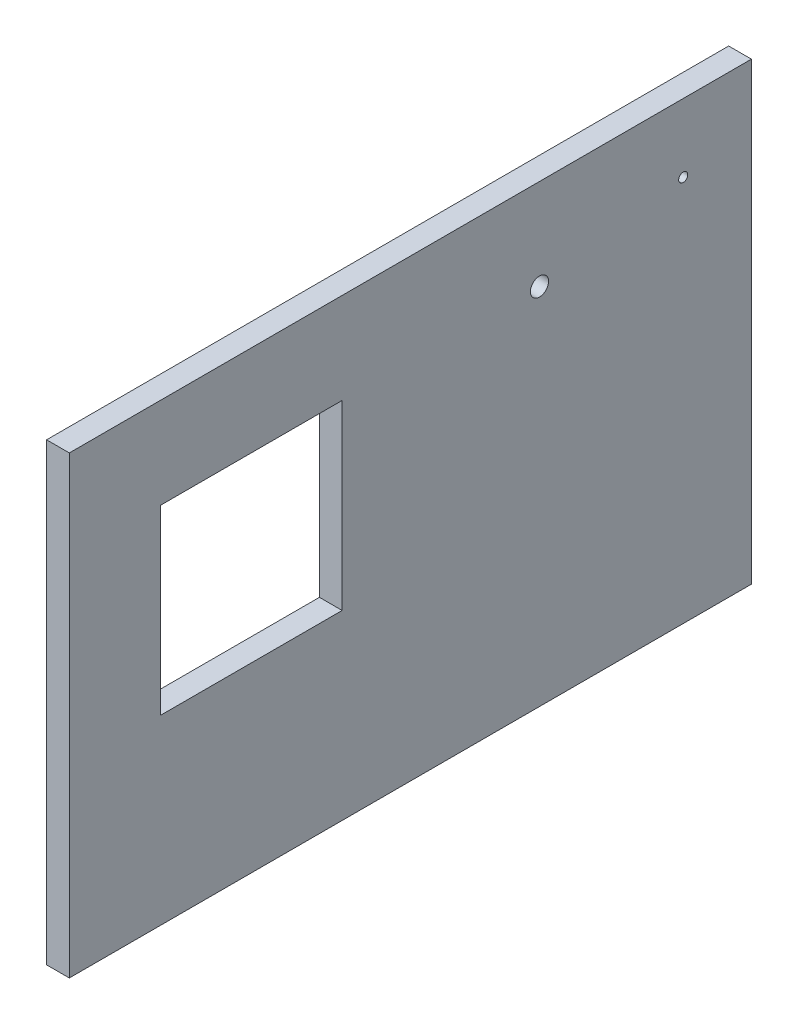
ISO-10303-21;
HEADER;
FILE_DESCRIPTION(('STEP AP214'),'2;1');
FILE_NAME('part.step','',(''),(''),'','','');
FILE_SCHEMA(('AUTOMOTIVE_DESIGN { 1 0 10303 214 1 1 1 1 }'));
ENDSEC;
DATA;
#1=APPLICATION_CONTEXT('core data for automotive mechanical design processes');
#2=APPLICATION_PROTOCOL_DEFINITION('international standard','automotive_design',2000,#1);
#3=PRODUCT_CONTEXT('',#1,'mechanical');
#4=PRODUCT('Part','Part','',(#3));
#5=PRODUCT_RELATED_PRODUCT_CATEGORY('part','',(#4));
#6=PRODUCT_DEFINITION_FORMATION('','',#4);
#7=PRODUCT_DEFINITION_CONTEXT('part definition',#1,'design');
#8=PRODUCT_DEFINITION('design','',#6,#7);
#9=PRODUCT_DEFINITION_SHAPE('','',#8);
#10=(LENGTH_UNIT() NAMED_UNIT(*) SI_UNIT(.MILLI.,.METRE.));
#11=(NAMED_UNIT(*) PLANE_ANGLE_UNIT() SI_UNIT($,.RADIAN.));
#12=(NAMED_UNIT(*) SI_UNIT($,.STERADIAN.) SOLID_ANGLE_UNIT());
#13=UNCERTAINTY_MEASURE_WITH_UNIT(LENGTH_MEASURE(1.E-05),#10,'distance_accuracy_value','');
#14=(GEOMETRIC_REPRESENTATION_CONTEXT(3) GLOBAL_UNCERTAINTY_ASSIGNED_CONTEXT((#13)) GLOBAL_UNIT_ASSIGNED_CONTEXT((#10,
#11,#12)) REPRESENTATION_CONTEXT('',''));
#15=CARTESIAN_POINT('',(0.,0.,0.));
#16=DIRECTION('',(0.,0.,1.));
#17=DIRECTION('',(1.,0.,0.));
#18=AXIS2_PLACEMENT_3D('',#15,#16,#17);
#19=CARTESIAN_POINT('',(10.,100.,-150.));
#20=DIRECTION('',(0.,0.,1.));
#21=DIRECTION('',(1.,0.,0.));
#22=AXIS2_PLACEMENT_3D('',#19,#20,#21);
#23=PLANE('',#22);
#24=DIRECTION('',(0.,1.,0.));
#25=VECTOR('',#24,1.);
#26=CARTESIAN_POINT('',(0.,100.,-150.));
#27=LINE('',#26,#25);
#28=CARTESIAN_POINT('',(0.,-100.,-150.));
#29=VERTEX_POINT('',#28);
#30=CARTESIAN_POINT('',(0.,100.,-150.));
#31=VERTEX_POINT('',#30);
#32=EDGE_CURVE('E141',#29,#31,#27,.T.);
#33=ORIENTED_EDGE('',*,*,#32,.T.);
#34=DIRECTION('',(-1.,0.,0.));
#35=VECTOR('',#34,1.);
#36=CARTESIAN_POINT('',(10.,100.,-150.));
#37=LINE('',#36,#35);
#38=CARTESIAN_POINT('',(10.,100.,-150.));
#39=VERTEX_POINT('',#38);
#40=EDGE_CURVE('E11',#39,#31,#37,.T.);
#41=ORIENTED_EDGE('',*,*,#40,.F.);
#42=DIRECTION('',(0.,1.,0.));
#43=VECTOR('',#42,1.);
#44=CARTESIAN_POINT('',(10.,100.,-150.));
#45=LINE('',#44,#43);
#46=CARTESIAN_POINT('',(10.,-100.,-150.));
#47=VERTEX_POINT('',#46);
#48=EDGE_CURVE('E150',#47,#39,#45,.T.);
#49=ORIENTED_EDGE('',*,*,#48,.F.);
#50=DIRECTION('',(-1.,0.,0.));
#51=VECTOR('',#50,1.);
#52=CARTESIAN_POINT('',(10.,-100.,-150.));
#53=LINE('',#52,#51);
#54=EDGE_CURVE('E160',#47,#29,#53,.T.);
#55=ORIENTED_EDGE('',*,*,#54,.T.);
#56=EDGE_LOOP('',(#33,#41,#49,#55));
#57=FACE_BOUND('',#56,.T.);
#58=ADVANCED_FACE('F37',(#57),#23,.F.);
#59=CARTESIAN_POINT('',(10.,100.,150.));
#60=DIRECTION('',(0.,-1.,0.));
#61=DIRECTION('',(0.,0.,-1.));
#62=AXIS2_PLACEMENT_3D('',#59,#60,#61);
#63=PLANE('',#62);
#64=DIRECTION('',(0.,0.,1.));
#65=VECTOR('',#64,1.);
#66=CARTESIAN_POINT('',(0.,100.,150.));
#67=LINE('',#66,#65);
#68=CARTESIAN_POINT('',(0.,100.,150.));
#69=VERTEX_POINT('',#68);
#70=EDGE_CURVE('E163',#31,#69,#67,.T.);
#71=ORIENTED_EDGE('',*,*,#70,.T.);
#72=DIRECTION('',(-1.,0.,0.));
#73=VECTOR('',#72,1.);
#74=CARTESIAN_POINT('',(10.,100.,150.));
#75=LINE('',#74,#73);
#76=CARTESIAN_POINT('',(10.,100.,150.));
#77=VERTEX_POINT('',#76);
#78=EDGE_CURVE('E44',#77,#69,#75,.T.);
#79=ORIENTED_EDGE('',*,*,#78,.F.);
#80=DIRECTION('',(0.,0.,1.));
#81=VECTOR('',#80,1.);
#82=CARTESIAN_POINT('',(10.,100.,150.));
#83=LINE('',#82,#81);
#84=EDGE_CURVE('E153',#39,#77,#83,.T.);
#85=ORIENTED_EDGE('',*,*,#84,.F.);
#86=ORIENTED_EDGE('',*,*,#40,.T.);
#87=EDGE_LOOP('',(#71,#79,#85,#86));
#88=FACE_BOUND('',#87,.T.);
#89=ADVANCED_FACE('F192',(#88),#63,.F.);
#90=CARTESIAN_POINT('',(10.,100.,150.));
#91=DIRECTION('',(0.,0.,-1.));
#92=DIRECTION('',(0.,1.,0.));
#93=AXIS2_PLACEMENT_3D('',#90,#91,#92);
#94=PLANE('',#93);
#95=DIRECTION('',(0.,-1.,0.));
#96=VECTOR('',#95,1.);
#97=CARTESIAN_POINT('',(0.,100.,150.));
#98=LINE('',#97,#96);
#99=CARTESIAN_POINT('',(0.,-100.,150.));
#100=VERTEX_POINT('',#99);
#101=EDGE_CURVE('E165',#69,#100,#98,.T.);
#102=ORIENTED_EDGE('',*,*,#101,.T.);
#103=DIRECTION('',(-1.,0.,0.));
#104=VECTOR('',#103,1.);
#105=CARTESIAN_POINT('',(10.,-100.,150.));
#106=LINE('',#105,#104);
#107=CARTESIAN_POINT('',(10.,-100.,150.));
#108=VERTEX_POINT('',#107);
#109=EDGE_CURVE('E170',#108,#100,#106,.T.);
#110=ORIENTED_EDGE('',*,*,#109,.F.);
#111=DIRECTION('',(0.,-1.,0.));
#112=VECTOR('',#111,1.);
#113=CARTESIAN_POINT('',(10.,100.,150.));
#114=LINE('',#113,#112);
#115=EDGE_CURVE('E156',#77,#108,#114,.T.);
#116=ORIENTED_EDGE('',*,*,#115,.F.);
#117=ORIENTED_EDGE('',*,*,#78,.T.);
#118=EDGE_LOOP('',(#102,#110,#116,#117));
#119=FACE_BOUND('',#118,.T.);
#120=ADVANCED_FACE('F177',(#119),#94,.F.);
#121=CARTESIAN_POINT('',(10.,-100.,150.));
#122=DIRECTION('',(0.,1.,0.));
#123=DIRECTION('',(0.,0.,1.));
#124=AXIS2_PLACEMENT_3D('',#121,#122,#123);
#125=PLANE('',#124);
#126=DIRECTION('',(0.,0.,-1.));
#127=VECTOR('',#126,1.);
#128=CARTESIAN_POINT('',(0.,-100.,150.));
#129=LINE('',#128,#127);
#130=EDGE_CURVE('E154',#100,#29,#129,.T.);
#131=ORIENTED_EDGE('',*,*,#130,.T.);
#132=ORIENTED_EDGE('',*,*,#54,.F.);
#133=DIRECTION('',(0.,0.,-1.));
#134=VECTOR('',#133,1.);
#135=CARTESIAN_POINT('',(10.,-100.,150.));
#136=LINE('',#135,#134);
#137=EDGE_CURVE('E158',#108,#47,#136,.T.);
#138=ORIENTED_EDGE('',*,*,#137,.F.);
#139=ORIENTED_EDGE('',*,*,#109,.T.);
#140=EDGE_LOOP('',(#131,#132,#138,#139));
#141=FACE_BOUND('',#140,.T.);
#142=ADVANCED_FACE('F185',(#141),#125,.F.);
#143=CARTESIAN_POINT('',(10.,0.,0.));
#144=DIRECTION('',(1.,0.,0.));
#145=DIRECTION('',(0.,0.,-1.));
#146=AXIS2_PLACEMENT_3D('',#143,#144,#145);
#147=PLANE('',#146);
#148=DIRECTION('',(0.,-1.,0.));
#149=VECTOR('',#148,1.);
#150=CARTESIAN_POINT('',(10.,-20.,110.));
#151=LINE('',#150,#149);
#152=CARTESIAN_POINT('',(10.,60.,110.));
#153=VERTEX_POINT('',#152);
#154=CARTESIAN_POINT('',(10.,-20.,110.));
#155=VERTEX_POINT('',#154);
#156=EDGE_CURVE('E51',#153,#155,#151,.T.);
#157=ORIENTED_EDGE('',*,*,#156,.F.);
#158=DIRECTION('',(0.,0.,1.));
#159=VECTOR('',#158,1.);
#160=CARTESIAN_POINT('',(10.,60.,30.));
#161=LINE('',#160,#159);
#162=CARTESIAN_POINT('',(10.,60.,30.));
#163=VERTEX_POINT('',#162);
#164=EDGE_CURVE('E119',#163,#153,#161,.T.);
#165=ORIENTED_EDGE('',*,*,#164,.F.);
#166=DIRECTION('',(0.,1.,0.));
#167=VECTOR('',#166,1.);
#168=CARTESIAN_POINT('',(10.,-20.,30.));
#169=LINE('',#168,#167);
#170=CARTESIAN_POINT('',(10.,-20.,30.));
#171=VERTEX_POINT('',#170);
#172=EDGE_CURVE('E122',#171,#163,#169,.T.);
#173=ORIENTED_EDGE('',*,*,#172,.F.);
#174=DIRECTION('',(0.,0.,-1.));
#175=VECTOR('',#174,1.);
#176=CARTESIAN_POINT('',(10.,-20.,30.));
#177=LINE('',#176,#175);
#178=EDGE_CURVE('E128',#155,#171,#177,.T.);
#179=ORIENTED_EDGE('',*,*,#178,.F.);
#180=EDGE_LOOP('',(#157,#165,#173,#179));
#181=FACE_BOUND('',#180,.T.);
#182=CARTESIAN_POINT('',(10.,70.,-120.));
#183=DIRECTION('',(1.,0.,0.));
#184=DIRECTION('',(0.,0.,-1.));
#185=AXIS2_PLACEMENT_3D('',#182,#183,#184);
#186=CIRCLE('',#185,2.);
#187=CARTESIAN_POINT('',(10.,70.,-122.));
#188=VERTEX_POINT('',#187);
#189=EDGE_CURVE('E142',#188,#188,#186,.T.);
#190=ORIENTED_EDGE('',*,*,#189,.F.);
#191=EDGE_LOOP('',(#190));
#192=FACE_BOUND('',#191,.T.);
#193=CARTESIAN_POINT('',(10.,60.,-56.7860774828835));
#194=DIRECTION('',(1.,0.,0.));
#195=DIRECTION('',(0.,0.,-1.));
#196=AXIS2_PLACEMENT_3D('',#193,#194,#195);
#197=CIRCLE('',#196,4.00000000000001);
#198=CARTESIAN_POINT('',(10.,60.,-60.7860774828835));
#199=VERTEX_POINT('',#198);
#200=EDGE_CURVE('E134',#199,#199,#197,.T.);
#201=ORIENTED_EDGE('',*,*,#200,.F.);
#202=EDGE_LOOP('',(#201));
#203=FACE_BOUND('',#202,.T.);
#204=ORIENTED_EDGE('',*,*,#48,.T.);
#205=ORIENTED_EDGE('',*,*,#84,.T.);
#206=ORIENTED_EDGE('',*,*,#115,.T.);
#207=ORIENTED_EDGE('',*,*,#137,.T.);
#208=EDGE_LOOP('',(#204,#205,#206,#207));
#209=FACE_BOUND('',#208,.T.);
#210=ADVANCED_FACE('F191',(#181,#192,#203,#209),#147,.T.);
#211=CARTESIAN_POINT('',(0.,0.,0.));
#212=DIRECTION('',(1.,0.,0.));
#213=DIRECTION('',(0.,0.,-1.));
#214=AXIS2_PLACEMENT_3D('',#211,#212,#213);
#215=PLANE('',#214);
#216=DIRECTION('',(0.,0.,1.));
#217=VECTOR('',#216,1.);
#218=CARTESIAN_POINT('',(0.,60.,30.));
#219=LINE('',#218,#217);
#220=CARTESIAN_POINT('',(0.,60.,30.));
#221=VERTEX_POINT('',#220);
#222=CARTESIAN_POINT('',(0.,60.,110.));
#223=VERTEX_POINT('',#222);
#224=EDGE_CURVE('E109',#221,#223,#219,.T.);
#225=ORIENTED_EDGE('',*,*,#224,.T.);
#226=DIRECTION('',(0.,-1.,0.));
#227=VECTOR('',#226,1.);
#228=CARTESIAN_POINT('',(0.,-20.,110.));
#229=LINE('',#228,#227);
#230=CARTESIAN_POINT('',(0.,-20.,110.));
#231=VERTEX_POINT('',#230);
#232=EDGE_CURVE('E103',#223,#231,#229,.T.);
#233=ORIENTED_EDGE('',*,*,#232,.T.);
#234=DIRECTION('',(0.,0.,-1.));
#235=VECTOR('',#234,1.);
#236=CARTESIAN_POINT('',(0.,-20.,30.));
#237=LINE('',#236,#235);
#238=CARTESIAN_POINT('',(0.,-20.,30.));
#239=VERTEX_POINT('',#238);
#240=EDGE_CURVE('E112',#231,#239,#237,.T.);
#241=ORIENTED_EDGE('',*,*,#240,.T.);
#242=DIRECTION('',(0.,1.,0.));
#243=VECTOR('',#242,1.);
#244=CARTESIAN_POINT('',(0.,-20.,30.));
#245=LINE('',#244,#243);
#246=EDGE_CURVE('E59',#239,#221,#245,.T.);
#247=ORIENTED_EDGE('',*,*,#246,.T.);
#248=EDGE_LOOP('',(#225,#233,#241,#247));
#249=FACE_BOUND('',#248,.T.);
#250=CARTESIAN_POINT('',(0.,70.,-120.));
#251=DIRECTION('',(1.,0.,0.));
#252=DIRECTION('',(0.,0.,-1.));
#253=AXIS2_PLACEMENT_3D('',#250,#251,#252);
#254=CIRCLE('',#253,2.);
#255=CARTESIAN_POINT('',(0.,70.,-122.));
#256=VERTEX_POINT('',#255);
#257=EDGE_CURVE('E138',#256,#256,#254,.T.);
#258=ORIENTED_EDGE('',*,*,#257,.T.);
#259=EDGE_LOOP('',(#258));
#260=FACE_BOUND('',#259,.T.);
#261=CARTESIAN_POINT('',(0.,60.,-56.7860774828835));
#262=DIRECTION('',(1.,0.,0.));
#263=DIRECTION('',(0.,0.,-1.));
#264=AXIS2_PLACEMENT_3D('',#261,#262,#263);
#265=CIRCLE('',#264,4.00000000000001);
#266=CARTESIAN_POINT('',(0.,60.,-60.7860774828835));
#267=VERTEX_POINT('',#266);
#268=EDGE_CURVE('E145',#267,#267,#265,.T.);
#269=ORIENTED_EDGE('',*,*,#268,.T.);
#270=EDGE_LOOP('',(#269));
#271=FACE_BOUND('',#270,.T.);
#272=ORIENTED_EDGE('',*,*,#32,.F.);
#273=ORIENTED_EDGE('',*,*,#130,.F.);
#274=ORIENTED_EDGE('',*,*,#101,.F.);
#275=ORIENTED_EDGE('',*,*,#70,.F.);
#276=EDGE_LOOP('',(#272,#273,#274,#275));
#277=FACE_BOUND('',#276,.T.);
#278=ADVANCED_FACE('F116',(#249,#260,#271,#277),#215,.F.);
#279=CARTESIAN_POINT('',(0.,60.,-56.7860774828835));
#280=DIRECTION('',(1.,0.,0.));
#281=DIRECTION('',(0.,0.,-1.));
#282=AXIS2_PLACEMENT_3D('',#279,#280,#281);
#283=CYLINDRICAL_SURFACE('',#282,4.00000000000001);
#284=ORIENTED_EDGE('',*,*,#268,.F.);
#285=EDGE_LOOP('',(#284));
#286=FACE_BOUND('',#285,.T.);
#287=ORIENTED_EDGE('',*,*,#200,.T.);
#288=EDGE_LOOP('',(#287));
#289=FACE_BOUND('',#288,.T.);
#290=ADVANCED_FACE('F204',(#286,#289),#283,.F.);
#291=CARTESIAN_POINT('',(0.,70.,-120.));
#292=DIRECTION('',(1.,0.,0.));
#293=DIRECTION('',(0.,0.,-1.));
#294=AXIS2_PLACEMENT_3D('',#291,#292,#293);
#295=CYLINDRICAL_SURFACE('',#294,2.);
#296=ORIENTED_EDGE('',*,*,#257,.F.);
#297=EDGE_LOOP('',(#296));
#298=FACE_BOUND('',#297,.T.);
#299=ORIENTED_EDGE('',*,*,#189,.T.);
#300=EDGE_LOOP('',(#299));
#301=FACE_BOUND('',#300,.T.);
#302=ADVANCED_FACE('F210',(#298,#301),#295,.F.);
#303=CARTESIAN_POINT('',(0.,-20.,110.));
#304=DIRECTION('',(0.,0.,1.));
#305=DIRECTION('',(1.,0.,0.));
#306=AXIS2_PLACEMENT_3D('',#303,#304,#305);
#307=PLANE('',#306);
#308=ORIENTED_EDGE('',*,*,#156,.T.);
#309=DIRECTION('',(1.,0.,0.));
#310=VECTOR('',#309,1.);
#311=CARTESIAN_POINT('',(0.,-20.,110.));
#312=LINE('',#311,#310);
#313=EDGE_CURVE('E99',#231,#155,#312,.T.);
#314=ORIENTED_EDGE('',*,*,#313,.F.);
#315=ORIENTED_EDGE('',*,*,#232,.F.);
#316=DIRECTION('',(1.,0.,0.));
#317=VECTOR('',#316,1.);
#318=CARTESIAN_POINT('',(0.,60.,110.));
#319=LINE('',#318,#317);
#320=EDGE_CURVE('E132',#223,#153,#319,.T.);
#321=ORIENTED_EDGE('',*,*,#320,.T.);
#322=EDGE_LOOP('',(#308,#314,#315,#321));
#323=FACE_BOUND('',#322,.T.);
#324=ADVANCED_FACE('F101',(#323),#307,.F.);
#325=CARTESIAN_POINT('',(0.,60.,30.));
#326=DIRECTION('',(0.,1.,0.));
#327=DIRECTION('',(0.,0.,1.));
#328=AXIS2_PLACEMENT_3D('',#325,#326,#327);
#329=PLANE('',#328);
#330=ORIENTED_EDGE('',*,*,#164,.T.);
#331=ORIENTED_EDGE('',*,*,#320,.F.);
#332=ORIENTED_EDGE('',*,*,#224,.F.);
#333=DIRECTION('',(1.,0.,0.));
#334=VECTOR('',#333,1.);
#335=CARTESIAN_POINT('',(0.,60.,30.));
#336=LINE('',#335,#334);
#337=EDGE_CURVE('E135',#221,#163,#336,.T.);
#338=ORIENTED_EDGE('',*,*,#337,.T.);
#339=EDGE_LOOP('',(#330,#331,#332,#338));
#340=FACE_BOUND('',#339,.T.);
#341=ADVANCED_FACE('F217',(#340),#329,.F.);
#342=CARTESIAN_POINT('',(0.,-20.,30.));
#343=DIRECTION('',(0.,0.,-1.));
#344=DIRECTION('',(-1.,0.,0.));
#345=AXIS2_PLACEMENT_3D('',#342,#343,#344);
#346=PLANE('',#345);
#347=ORIENTED_EDGE('',*,*,#172,.T.);
#348=ORIENTED_EDGE('',*,*,#337,.F.);
#349=ORIENTED_EDGE('',*,*,#246,.F.);
#350=DIRECTION('',(1.,0.,0.));
#351=VECTOR('',#350,1.);
#352=CARTESIAN_POINT('',(0.,-20.,30.));
#353=LINE('',#352,#351);
#354=EDGE_CURVE('E108',#239,#171,#353,.T.);
#355=ORIENTED_EDGE('',*,*,#354,.T.);
#356=EDGE_LOOP('',(#347,#348,#349,#355));
#357=FACE_BOUND('',#356,.T.);
#358=ADVANCED_FACE('F220',(#357),#346,.F.);
#359=CARTESIAN_POINT('',(0.,-20.,30.));
#360=DIRECTION('',(0.,-1.,0.));
#361=DIRECTION('',(0.,0.,-1.));
#362=AXIS2_PLACEMENT_3D('',#359,#360,#361);
#363=PLANE('',#362);
#364=ORIENTED_EDGE('',*,*,#178,.T.);
#365=ORIENTED_EDGE('',*,*,#354,.F.);
#366=ORIENTED_EDGE('',*,*,#240,.F.);
#367=ORIENTED_EDGE('',*,*,#313,.T.);
#368=EDGE_LOOP('',(#364,#365,#366,#367));
#369=FACE_BOUND('',#368,.T.);
#370=ADVANCED_FACE('F113',(#369),#363,.F.);
#371=CLOSED_SHELL('',(#58,#89,#120,#142,#210,#278,#290,#302,#324,#341,#358,#370));
#372=MANIFOLD_SOLID_BREP('B2',#371);
#373=ADVANCED_BREP_SHAPE_REPRESENTATION('',(#18,#372),#14);
#374=SHAPE_DEFINITION_REPRESENTATION(#9,#373);
ENDSEC;
END-ISO-10303-21;
